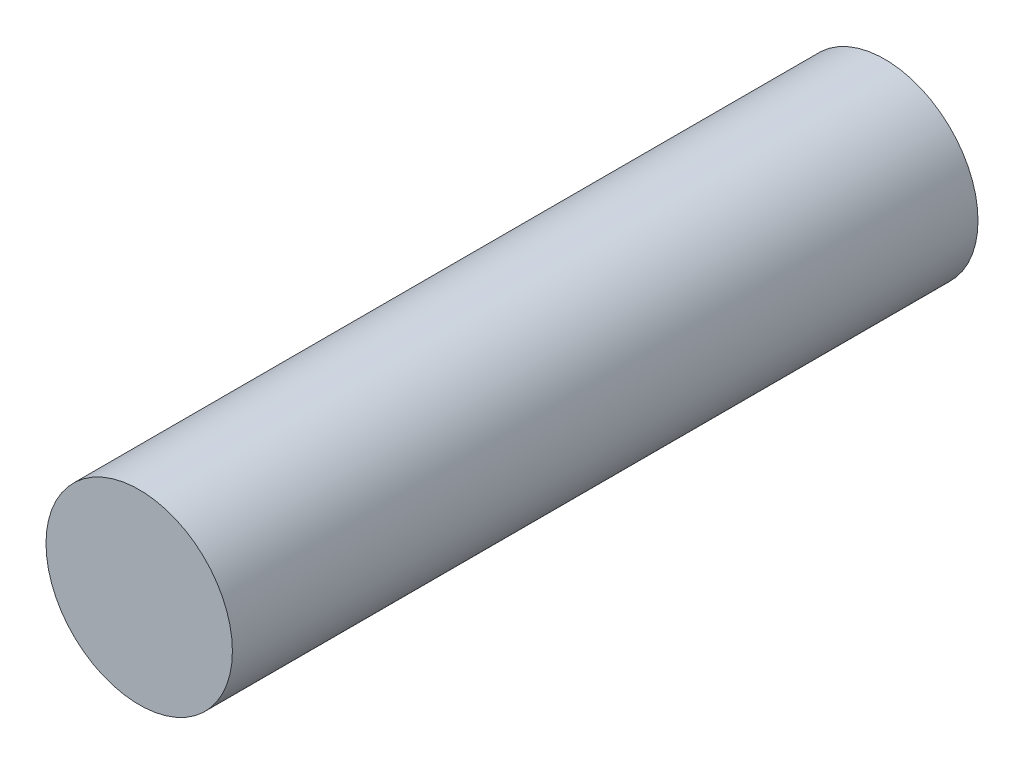
ISO-10303-21;
HEADER;
FILE_DESCRIPTION(('STEP AP214'),'2;1');
FILE_NAME('part.step','',(''),(''),'','','');
FILE_SCHEMA(('AUTOMOTIVE_DESIGN { 1 0 10303 214 1 1 1 1 }'));
ENDSEC;
DATA;
#1=APPLICATION_CONTEXT('core data for automotive mechanical design processes');
#2=APPLICATION_PROTOCOL_DEFINITION('international standard','automotive_design',2000,#1);
#3=PRODUCT_CONTEXT('',#1,'mechanical');
#4=PRODUCT('Part','Part','',(#3));
#5=PRODUCT_RELATED_PRODUCT_CATEGORY('part','',(#4));
#6=PRODUCT_DEFINITION_FORMATION('','',#4);
#7=PRODUCT_DEFINITION_CONTEXT('part definition',#1,'design');
#8=PRODUCT_DEFINITION('design','',#6,#7);
#9=PRODUCT_DEFINITION_SHAPE('','',#8);
#10=(LENGTH_UNIT() NAMED_UNIT(*) SI_UNIT(.MILLI.,.METRE.));
#11=(NAMED_UNIT(*) PLANE_ANGLE_UNIT() SI_UNIT($,.RADIAN.));
#12=(NAMED_UNIT(*) SI_UNIT($,.STERADIAN.) SOLID_ANGLE_UNIT());
#13=UNCERTAINTY_MEASURE_WITH_UNIT(LENGTH_MEASURE(1.E-05),#10,'distance_accuracy_value','');
#14=(GEOMETRIC_REPRESENTATION_CONTEXT(3) GLOBAL_UNCERTAINTY_ASSIGNED_CONTEXT((#13)) GLOBAL_UNIT_ASSIGNED_CONTEXT((#10,
#11,#12)) REPRESENTATION_CONTEXT('',''));
#15=CARTESIAN_POINT('',(0.,0.,0.));
#16=DIRECTION('',(0.,0.,1.));
#17=DIRECTION('',(1.,0.,0.));
#18=AXIS2_PLACEMENT_3D('',#15,#16,#17);
#19=CARTESIAN_POINT('',(0.,0.,12.7));
#20=DIRECTION('',(0.,0.,-1.));
#21=DIRECTION('',(-1.,0.,0.));
#22=AXIS2_PLACEMENT_3D('',#19,#20,#21);
#23=CYLINDRICAL_SURFACE('',#22,3.175);
#24=CARTESIAN_POINT('',(0.,0.,12.7));
#25=DIRECTION('',(0.,0.,1.));
#26=DIRECTION('',(1.,0.,0.));
#27=AXIS2_PLACEMENT_3D('',#24,#25,#26);
#28=CIRCLE('',#27,3.175);
#29=CARTESIAN_POINT('',(3.175,0.,12.7));
#30=VERTEX_POINT('',#29);
#31=EDGE_CURVE('E10',#30,#30,#28,.T.);
#32=ORIENTED_EDGE('',*,*,#31,.F.);
#33=EDGE_LOOP('',(#32));
#34=FACE_BOUND('',#33,.T.);
#35=CARTESIAN_POINT('',(0.,0.,-12.7));
#36=DIRECTION('',(0.,0.,1.));
#37=DIRECTION('',(1.,0.,0.));
#38=AXIS2_PLACEMENT_3D('',#35,#36,#37);
#39=CIRCLE('',#38,3.175);
#40=CARTESIAN_POINT('',(3.175,0.,-12.7));
#41=VERTEX_POINT('',#40);
#42=EDGE_CURVE('E40',#41,#41,#39,.T.);
#43=ORIENTED_EDGE('',*,*,#42,.T.);
#44=EDGE_LOOP('',(#43));
#45=FACE_BOUND('',#44,.T.);
#46=ADVANCED_FACE('F37',(#34,#45),#23,.T.);
#47=CARTESIAN_POINT('',(0.,0.,12.7));
#48=DIRECTION('',(0.,0.,1.));
#49=DIRECTION('',(1.,0.,0.));
#50=AXIS2_PLACEMENT_3D('',#47,#48,#49);
#51=PLANE('',#50);
#52=ORIENTED_EDGE('',*,*,#31,.T.);
#53=EDGE_LOOP('',(#52));
#54=FACE_BOUND('',#53,.T.);
#55=ADVANCED_FACE('F54',(#54),#51,.T.);
#56=CARTESIAN_POINT('',(0.,0.,-12.7));
#57=DIRECTION('',(0.,0.,1.));
#58=DIRECTION('',(1.,0.,0.));
#59=AXIS2_PLACEMENT_3D('',#56,#57,#58);
#60=PLANE('',#59);
#61=ORIENTED_EDGE('',*,*,#42,.F.);
#62=EDGE_LOOP('',(#61));
#63=FACE_BOUND('',#62,.T.);
#64=ADVANCED_FACE('F52',(#63),#60,.F.);
#65=CLOSED_SHELL('',(#46,#55,#64));
#66=MANIFOLD_SOLID_BREP('B2',#65);
#67=ADVANCED_BREP_SHAPE_REPRESENTATION('',(#18,#66),#14);
#68=SHAPE_DEFINITION_REPRESENTATION(#9,#67);
ENDSEC;
END-ISO-10303-21;
